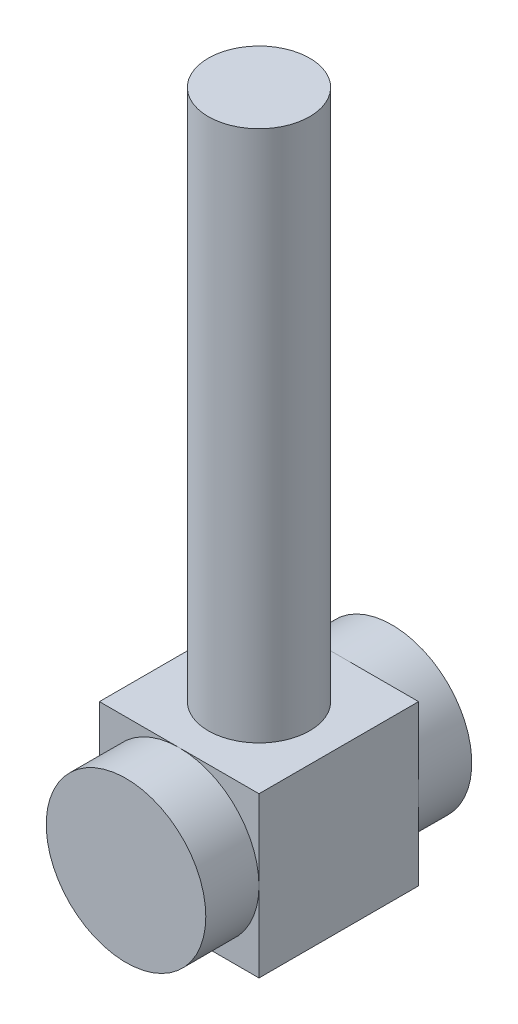
ISO-10303-21;
HEADER;
FILE_DESCRIPTION(('STEP AP214'),'2;1');
FILE_NAME('part.step','',(''),(''),'','','');
FILE_SCHEMA(('AUTOMOTIVE_DESIGN { 1 0 10303 214 1 1 1 1 }'));
ENDSEC;
DATA;
#1=APPLICATION_CONTEXT('core data for automotive mechanical design processes');
#2=APPLICATION_PROTOCOL_DEFINITION('international standard','automotive_design',2000,#1);
#3=PRODUCT_CONTEXT('',#1,'mechanical');
#4=PRODUCT('Part','Part','',(#3));
#5=PRODUCT_RELATED_PRODUCT_CATEGORY('part','',(#4));
#6=PRODUCT_DEFINITION_FORMATION('','',#4);
#7=PRODUCT_DEFINITION_CONTEXT('part definition',#1,'design');
#8=PRODUCT_DEFINITION('design','',#6,#7);
#9=PRODUCT_DEFINITION_SHAPE('','',#8);
#10=(LENGTH_UNIT() NAMED_UNIT(*) SI_UNIT(.MILLI.,.METRE.));
#11=(NAMED_UNIT(*) PLANE_ANGLE_UNIT() SI_UNIT($,.RADIAN.));
#12=(NAMED_UNIT(*) SI_UNIT($,.STERADIAN.) SOLID_ANGLE_UNIT());
#13=UNCERTAINTY_MEASURE_WITH_UNIT(LENGTH_MEASURE(1.E-05),#10,'distance_accuracy_value','');
#14=(GEOMETRIC_REPRESENTATION_CONTEXT(3) GLOBAL_UNCERTAINTY_ASSIGNED_CONTEXT((#13)) GLOBAL_UNIT_ASSIGNED_CONTEXT((#10,
#11,#12)) REPRESENTATION_CONTEXT('',''));
#15=CARTESIAN_POINT('',(0.,0.,0.));
#16=DIRECTION('',(0.,0.,1.));
#17=DIRECTION('',(1.,0.,0.));
#18=AXIS2_PLACEMENT_3D('',#15,#16,#17);
#19=CARTESIAN_POINT('',(0.,0.,-15.));
#20=DIRECTION('',(0.,0.,1.));
#21=DIRECTION('',(1.,0.,0.));
#22=AXIS2_PLACEMENT_3D('',#19,#20,#21);
#23=PLANE('',#22);
#24=CARTESIAN_POINT('',(0.,0.,-15.));
#25=DIRECTION('',(0.,0.,-1.));
#26=DIRECTION('',(-1.,0.,0.));
#27=AXIS2_PLACEMENT_3D('',#24,#25,#26);
#28=CIRCLE('',#27,15.);
#29=CARTESIAN_POINT('',(-15.,0.,-15.));
#30=VERTEX_POINT('',#29);
#31=CARTESIAN_POINT('',(0.,15.,-15.));
#32=VERTEX_POINT('',#31);
#33=EDGE_CURVE('E53',#30,#32,#28,.T.);
#34=ORIENTED_EDGE('',*,*,#33,.F.);
#35=DIRECTION('',(0.,-1.,0.));
#36=VECTOR('',#35,1.);
#37=CARTESIAN_POINT('',(-15.,15.,-15.));
#38=LINE('',#37,#36);
#39=CARTESIAN_POINT('',(-15.,15.,-15.));
#40=VERTEX_POINT('',#39);
#41=EDGE_CURVE('E112',#40,#30,#38,.T.);
#42=ORIENTED_EDGE('',*,*,#41,.F.);
#43=DIRECTION('',(-1.,0.,0.));
#44=VECTOR('',#43,1.);
#45=CARTESIAN_POINT('',(-15.,15.,-15.));
#46=LINE('',#45,#44);
#47=EDGE_CURVE('E131',#32,#40,#46,.T.);
#48=ORIENTED_EDGE('',*,*,#47,.F.);
#49=EDGE_LOOP('',(#34,#42,#48));
#50=FACE_BOUND('',#49,.T.);
#51=ADVANCED_FACE('F41',(#50),#23,.F.);
#52=CARTESIAN_POINT('',(15.,0.,-15.));
#53=VERTEX_POINT('',#52);
#54=EDGE_CURVE('E11',#32,#53,#28,.T.);
#55=ORIENTED_EDGE('',*,*,#54,.F.);
#56=CARTESIAN_POINT('',(15.,15.,-15.));
#57=VERTEX_POINT('',#56);
#58=EDGE_CURVE('E129',#57,#32,#46,.T.);
#59=ORIENTED_EDGE('',*,*,#58,.F.);
#60=DIRECTION('',(0.,1.,0.));
#61=VECTOR('',#60,1.);
#62=CARTESIAN_POINT('',(15.,15.,-15.));
#63=LINE('',#62,#61);
#64=EDGE_CURVE('E153',#53,#57,#63,.T.);
#65=ORIENTED_EDGE('',*,*,#64,.F.);
#66=EDGE_LOOP('',(#55,#59,#65));
#67=FACE_BOUND('',#66,.T.);
#68=ADVANCED_FACE('F243',(#67),#23,.F.);
#69=CARTESIAN_POINT('',(0.,-15.,-15.));
#70=VERTEX_POINT('',#69);
#71=EDGE_CURVE('E51',#53,#70,#28,.T.);
#72=ORIENTED_EDGE('',*,*,#71,.F.);
#73=CARTESIAN_POINT('',(15.,-15.,-15.));
#74=VERTEX_POINT('',#73);
#75=EDGE_CURVE('E178',#74,#53,#63,.T.);
#76=ORIENTED_EDGE('',*,*,#75,.F.);
#77=DIRECTION('',(1.,0.,0.));
#78=VECTOR('',#77,1.);
#79=CARTESIAN_POINT('',(-15.,-15.,-15.));
#80=LINE('',#79,#78);
#81=EDGE_CURVE('E123',#70,#74,#80,.T.);
#82=ORIENTED_EDGE('',*,*,#81,.F.);
#83=EDGE_LOOP('',(#72,#76,#82));
#84=FACE_BOUND('',#83,.T.);
#85=ADVANCED_FACE('F248',(#84),#23,.F.);
#86=CARTESIAN_POINT('',(0.,0.,15.));
#87=DIRECTION('',(0.,0.,1.));
#88=DIRECTION('',(1.,0.,0.));
#89=AXIS2_PLACEMENT_3D('',#86,#87,#88);
#90=PLANE('',#89);
#91=CARTESIAN_POINT('',(0.,0.,15.));
#92=DIRECTION('',(0.,0.,1.));
#93=DIRECTION('',(1.,0.,0.));
#94=AXIS2_PLACEMENT_3D('',#91,#92,#93);
#95=CIRCLE('',#94,15.);
#96=CARTESIAN_POINT('',(15.,0.,15.));
#97=VERTEX_POINT('',#96);
#98=CARTESIAN_POINT('',(0.,15.,15.));
#99=VERTEX_POINT('',#98);
#100=EDGE_CURVE('E146',#97,#99,#95,.T.);
#101=ORIENTED_EDGE('',*,*,#100,.F.);
#102=DIRECTION('',(0.,1.,0.));
#103=VECTOR('',#102,1.);
#104=CARTESIAN_POINT('',(15.,15.,15.));
#105=LINE('',#104,#103);
#106=CARTESIAN_POINT('',(15.,15.,15.));
#107=VERTEX_POINT('',#106);
#108=EDGE_CURVE('E162',#97,#107,#105,.T.);
#109=ORIENTED_EDGE('',*,*,#108,.T.);
#110=DIRECTION('',(-1.,0.,0.));
#111=VECTOR('',#110,1.);
#112=CARTESIAN_POINT('',(-15.,15.,15.));
#113=LINE('',#112,#111);
#114=EDGE_CURVE('E163',#107,#99,#113,.T.);
#115=ORIENTED_EDGE('',*,*,#114,.T.);
#116=EDGE_LOOP('',(#101,#109,#115));
#117=FACE_BOUND('',#116,.T.);
#118=ADVANCED_FACE('F261',(#117),#90,.T.);
#119=CARTESIAN_POINT('',(-15.,0.,15.));
#120=VERTEX_POINT('',#119);
#121=EDGE_CURVE('E140',#99,#120,#95,.T.);
#122=ORIENTED_EDGE('',*,*,#121,.F.);
#123=CARTESIAN_POINT('',(-15.,15.,15.));
#124=VERTEX_POINT('',#123);
#125=EDGE_CURVE('E161',#99,#124,#113,.T.);
#126=ORIENTED_EDGE('',*,*,#125,.T.);
#127=DIRECTION('',(0.,-1.,0.));
#128=VECTOR('',#127,1.);
#129=CARTESIAN_POINT('',(-15.,15.,15.));
#130=LINE('',#129,#128);
#131=EDGE_CURVE('E168',#124,#120,#130,.T.);
#132=ORIENTED_EDGE('',*,*,#131,.T.);
#133=EDGE_LOOP('',(#122,#126,#132));
#134=FACE_BOUND('',#133,.T.);
#135=ADVANCED_FACE('F209',(#134),#90,.T.);
#136=CARTESIAN_POINT('',(0.,-15.,15.));
#137=VERTEX_POINT('',#136);
#138=EDGE_CURVE('E144',#120,#137,#95,.T.);
#139=ORIENTED_EDGE('',*,*,#138,.F.);
#140=CARTESIAN_POINT('',(-15.,-15.,15.));
#141=VERTEX_POINT('',#140);
#142=EDGE_CURVE('E167',#120,#141,#130,.T.);
#143=ORIENTED_EDGE('',*,*,#142,.T.);
#144=DIRECTION('',(1.,0.,0.));
#145=VECTOR('',#144,1.);
#146=CARTESIAN_POINT('',(-15.,-15.,15.));
#147=LINE('',#146,#145);
#148=EDGE_CURVE('E173',#141,#137,#147,.T.);
#149=ORIENTED_EDGE('',*,*,#148,.T.);
#150=EDGE_LOOP('',(#139,#143,#149));
#151=FACE_BOUND('',#150,.T.);
#152=ADVANCED_FACE('F205',(#151),#90,.T.);
#153=CARTESIAN_POINT('',(15.,15.,15.));
#154=DIRECTION('',(-1.,0.,0.));
#155=DIRECTION('',(0.,-1.,0.));
#156=AXIS2_PLACEMENT_3D('',#153,#154,#155);
#157=PLANE('',#156);
#158=ORIENTED_EDGE('',*,*,#75,.T.);
#159=ORIENTED_EDGE('',*,*,#64,.T.);
#160=DIRECTION('',(0.,0.,-1.));
#161=VECTOR('',#160,1.);
#162=CARTESIAN_POINT('',(15.,15.,15.));
#163=LINE('',#162,#161);
#164=EDGE_CURVE('E45',#107,#57,#163,.T.);
#165=ORIENTED_EDGE('',*,*,#164,.F.);
#166=ORIENTED_EDGE('',*,*,#108,.F.);
#167=CARTESIAN_POINT('',(15.,-15.,15.));
#168=VERTEX_POINT('',#167);
#169=EDGE_CURVE('E158',#168,#97,#105,.T.);
#170=ORIENTED_EDGE('',*,*,#169,.F.);
#171=DIRECTION('',(0.,0.,-1.));
#172=VECTOR('',#171,1.);
#173=CARTESIAN_POINT('',(15.,-15.,15.));
#174=LINE('',#173,#172);
#175=EDGE_CURVE('E177',#168,#74,#174,.T.);
#176=ORIENTED_EDGE('',*,*,#175,.T.);
#177=EDGE_LOOP('',(#158,#159,#165,#166,#170,#176));
#178=FACE_BOUND('',#177,.T.);
#179=ADVANCED_FACE('F43',(#178),#157,.F.);
#180=CARTESIAN_POINT('',(-15.,15.,15.));
#181=DIRECTION('',(0.,-1.,0.));
#182=DIRECTION('',(0.,0.,-1.));
#183=AXIS2_PLACEMENT_3D('',#180,#181,#182);
#184=PLANE('',#183);
#185=CARTESIAN_POINT('',(0.,15.,0.));
#186=DIRECTION('',(0.,1.,0.));
#187=DIRECTION('',(0.,0.,1.));
#188=AXIS2_PLACEMENT_3D('',#185,#186,#187);
#189=CIRCLE('',#188,9.52833378143429);
#190=CARTESIAN_POINT('',(0.,15.,9.52833378143429));
#191=VERTEX_POINT('',#190);
#192=EDGE_CURVE('E136',#191,#191,#189,.T.);
#193=ORIENTED_EDGE('',*,*,#192,.F.);
#194=EDGE_LOOP('',(#193));
#195=FACE_BOUND('',#194,.T.);
#196=ORIENTED_EDGE('',*,*,#58,.T.);
#197=ORIENTED_EDGE('',*,*,#47,.T.);
#198=DIRECTION('',(0.,0.,-1.));
#199=VECTOR('',#198,1.);
#200=CARTESIAN_POINT('',(-15.,15.,15.));
#201=LINE('',#200,#199);
#202=EDGE_CURVE('E119',#124,#40,#201,.T.);
#203=ORIENTED_EDGE('',*,*,#202,.F.);
#204=ORIENTED_EDGE('',*,*,#125,.F.);
#205=ORIENTED_EDGE('',*,*,#114,.F.);
#206=ORIENTED_EDGE('',*,*,#164,.T.);
#207=EDGE_LOOP('',(#196,#197,#203,#204,#205,#206));
#208=FACE_BOUND('',#207,.T.);
#209=ADVANCED_FACE('F212',(#195,#208),#184,.F.);
#210=CARTESIAN_POINT('',(-15.,15.,15.));
#211=DIRECTION('',(1.,0.,0.));
#212=DIRECTION('',(0.,1.,0.));
#213=AXIS2_PLACEMENT_3D('',#210,#211,#212);
#214=PLANE('',#213);
#215=ORIENTED_EDGE('',*,*,#41,.T.);
#216=CARTESIAN_POINT('',(-15.,-15.,-15.));
#217=VERTEX_POINT('',#216);
#218=EDGE_CURVE('E115',#30,#217,#38,.T.);
#219=ORIENTED_EDGE('',*,*,#218,.T.);
#220=DIRECTION('',(0.,0.,-1.));
#221=VECTOR('',#220,1.);
#222=CARTESIAN_POINT('',(-15.,-15.,15.));
#223=LINE('',#222,#221);
#224=EDGE_CURVE('E189',#141,#217,#223,.T.);
#225=ORIENTED_EDGE('',*,*,#224,.F.);
#226=ORIENTED_EDGE('',*,*,#142,.F.);
#227=ORIENTED_EDGE('',*,*,#131,.F.);
#228=ORIENTED_EDGE('',*,*,#202,.T.);
#229=EDGE_LOOP('',(#215,#219,#225,#226,#227,#228));
#230=FACE_BOUND('',#229,.T.);
#231=ADVANCED_FACE('F113',(#230),#214,.F.);
#232=CARTESIAN_POINT('',(-15.,-15.,15.));
#233=DIRECTION('',(0.,1.,0.));
#234=DIRECTION('',(0.,0.,1.));
#235=AXIS2_PLACEMENT_3D('',#232,#233,#234);
#236=PLANE('',#235);
#237=EDGE_CURVE('E127',#217,#70,#80,.T.);
#238=ORIENTED_EDGE('',*,*,#237,.T.);
#239=ORIENTED_EDGE('',*,*,#81,.T.);
#240=ORIENTED_EDGE('',*,*,#175,.F.);
#241=EDGE_CURVE('E172',#137,#168,#147,.T.);
#242=ORIENTED_EDGE('',*,*,#241,.F.);
#243=ORIENTED_EDGE('',*,*,#148,.F.);
#244=ORIENTED_EDGE('',*,*,#224,.T.);
#245=EDGE_LOOP('',(#238,#239,#240,#242,#243,#244));
#246=FACE_BOUND('',#245,.T.);
#247=ADVANCED_FACE('F239',(#246),#236,.F.);
#248=EDGE_CURVE('E157',#137,#97,#95,.T.);
#249=ORIENTED_EDGE('',*,*,#248,.F.);
#250=ORIENTED_EDGE('',*,*,#241,.T.);
#251=ORIENTED_EDGE('',*,*,#169,.T.);
#252=EDGE_LOOP('',(#249,#250,#251));
#253=FACE_BOUND('',#252,.T.);
#254=ADVANCED_FACE('F252',(#253),#90,.T.);
#255=EDGE_CURVE('E66',#70,#30,#28,.T.);
#256=ORIENTED_EDGE('',*,*,#255,.F.);
#257=ORIENTED_EDGE('',*,*,#237,.F.);
#258=ORIENTED_EDGE('',*,*,#218,.F.);
#259=EDGE_LOOP('',(#256,#257,#258));
#260=FACE_BOUND('',#259,.T.);
#261=ADVANCED_FACE('F125',(#260),#23,.F.);
#262=CARTESIAN_POINT('',(0.,0.,25.));
#263=DIRECTION('',(0.,0.,-1.));
#264=DIRECTION('',(-1.,0.,0.));
#265=AXIS2_PLACEMENT_3D('',#262,#263,#264);
#266=CYLINDRICAL_SURFACE('',#265,15.);
#267=CARTESIAN_POINT('',(0.,0.,25.));
#268=DIRECTION('',(0.,0.,1.));
#269=DIRECTION('',(1.,0.,0.));
#270=AXIS2_PLACEMENT_3D('',#267,#268,#269);
#271=CIRCLE('',#270,15.);
#272=CARTESIAN_POINT('',(15.,0.,25.));
#273=VERTEX_POINT('',#272);
#274=EDGE_CURVE('E150',#273,#273,#271,.T.);
#275=ORIENTED_EDGE('',*,*,#274,.F.);
#276=EDGE_LOOP('',(#275));
#277=FACE_BOUND('',#276,.T.);
#278=ORIENTED_EDGE('',*,*,#100,.T.);
#279=ORIENTED_EDGE('',*,*,#121,.T.);
#280=ORIENTED_EDGE('',*,*,#138,.T.);
#281=ORIENTED_EDGE('',*,*,#248,.T.);
#282=EDGE_LOOP('',(#278,#279,#280,#281));
#283=FACE_BOUND('',#282,.T.);
#284=ADVANCED_FACE('F202',(#277,#283),#266,.T.);
#285=CARTESIAN_POINT('',(0.,0.,25.));
#286=DIRECTION('',(0.,0.,1.));
#287=DIRECTION('',(1.,0.,0.));
#288=AXIS2_PLACEMENT_3D('',#285,#286,#287);
#289=PLANE('',#288);
#290=ORIENTED_EDGE('',*,*,#274,.T.);
#291=EDGE_LOOP('',(#290));
#292=FACE_BOUND('',#291,.T.);
#293=ADVANCED_FACE('F257',(#292),#289,.T.);
#294=CARTESIAN_POINT('',(0.,0.,-25.));
#295=DIRECTION('',(0.,0.,1.));
#296=DIRECTION('',(1.,0.,0.));
#297=AXIS2_PLACEMENT_3D('',#294,#295,#296);
#298=CYLINDRICAL_SURFACE('',#297,15.);
#299=CARTESIAN_POINT('',(0.,0.,-25.));
#300=DIRECTION('',(0.,0.,-1.));
#301=DIRECTION('',(-1.,0.,0.));
#302=AXIS2_PLACEMENT_3D('',#299,#300,#301);
#303=CIRCLE('',#302,15.);
#304=CARTESIAN_POINT('',(-15.,0.,-25.));
#305=VERTEX_POINT('',#304);
#306=EDGE_CURVE('E135',#305,#305,#303,.T.);
#307=ORIENTED_EDGE('',*,*,#306,.F.);
#308=EDGE_LOOP('',(#307));
#309=FACE_BOUND('',#308,.T.);
#310=ORIENTED_EDGE('',*,*,#33,.T.);
#311=ORIENTED_EDGE('',*,*,#54,.T.);
#312=ORIENTED_EDGE('',*,*,#71,.T.);
#313=ORIENTED_EDGE('',*,*,#255,.T.);
#314=EDGE_LOOP('',(#310,#311,#312,#313));
#315=FACE_BOUND('',#314,.T.);
#316=ADVANCED_FACE('F138',(#309,#315),#298,.T.);
#317=CARTESIAN_POINT('',(0.,0.,-25.));
#318=DIRECTION('',(0.,0.,-1.));
#319=DIRECTION('',(-1.,0.,0.));
#320=AXIS2_PLACEMENT_3D('',#317,#318,#319);
#321=PLANE('',#320);
#322=ORIENTED_EDGE('',*,*,#306,.T.);
#323=EDGE_LOOP('',(#322));
#324=FACE_BOUND('',#323,.T.);
#325=ADVANCED_FACE('F230',(#324),#321,.T.);
#326=CARTESIAN_POINT('',(0.,115.,0.));
#327=DIRECTION('',(0.,-1.,0.));
#328=DIRECTION('',(0.,0.,-1.));
#329=AXIS2_PLACEMENT_3D('',#326,#327,#328);
#330=CYLINDRICAL_SURFACE('',#329,9.52833378143429);
#331=CARTESIAN_POINT('',(0.,115.,0.));
#332=DIRECTION('',(0.,1.,0.));
#333=DIRECTION('',(0.,0.,1.));
#334=AXIS2_PLACEMENT_3D('',#331,#332,#333);
#335=CIRCLE('',#334,9.52833378143429);
#336=CARTESIAN_POINT('',(0.,115.,9.52833378143429));
#337=VERTEX_POINT('',#336);
#338=EDGE_CURVE('E220',#337,#337,#335,.T.);
#339=ORIENTED_EDGE('',*,*,#338,.F.);
#340=EDGE_LOOP('',(#339));
#341=FACE_BOUND('',#340,.T.);
#342=ORIENTED_EDGE('',*,*,#192,.T.);
#343=EDGE_LOOP('',(#342));
#344=FACE_BOUND('',#343,.T.);
#345=ADVANCED_FACE('F227',(#341,#344),#330,.T.);
#346=CARTESIAN_POINT('',(0.,115.,0.));
#347=DIRECTION('',(0.,1.,0.));
#348=DIRECTION('',(0.,0.,1.));
#349=AXIS2_PLACEMENT_3D('',#346,#347,#348);
#350=PLANE('',#349);
#351=ORIENTED_EDGE('',*,*,#338,.T.);
#352=EDGE_LOOP('',(#351));
#353=FACE_BOUND('',#352,.T.);
#354=ADVANCED_FACE('F225',(#353),#350,.T.);
#355=CLOSED_SHELL('',(#51,#68,#85,#118,#135,#152,#179,#209,#231,#247,#254,#261,#284,#293,#316,
#325,#345,#354));
#356=MANIFOLD_SOLID_BREP('B2',#355);
#357=ADVANCED_BREP_SHAPE_REPRESENTATION('',(#18,#356),#14);
#358=SHAPE_DEFINITION_REPRESENTATION(#9,#357);
ENDSEC;
END-ISO-10303-21;
